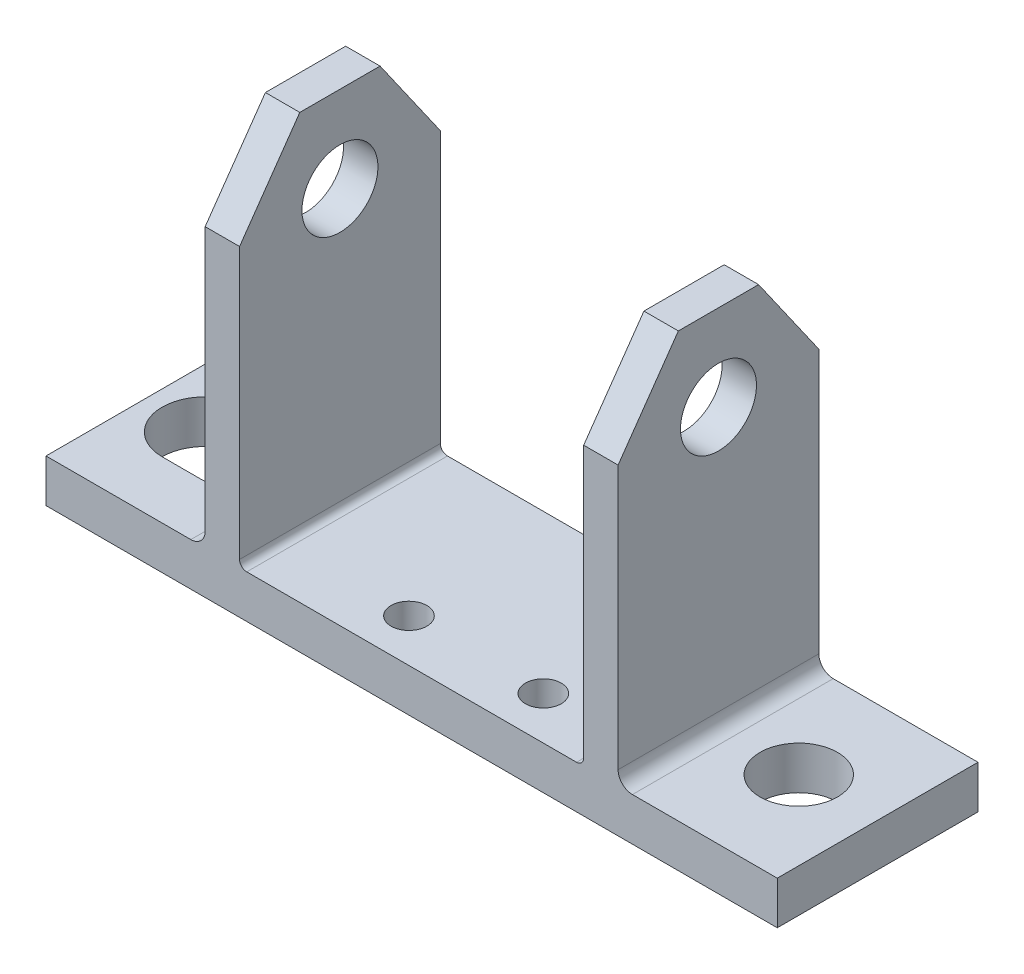
ISO-10303-21;
HEADER;
FILE_DESCRIPTION(('STEP AP214'),'2;1');
FILE_NAME('part.step','',(''),(''),'','','');
FILE_SCHEMA(('AUTOMOTIVE_DESIGN { 1 0 10303 214 1 1 1 1 }'));
ENDSEC;
DATA;
#1=APPLICATION_CONTEXT('core data for automotive mechanical design processes');
#2=APPLICATION_PROTOCOL_DEFINITION('international standard','automotive_design',2000,#1);
#3=PRODUCT_CONTEXT('',#1,'mechanical');
#4=PRODUCT('Part','Part','',(#3));
#5=PRODUCT_RELATED_PRODUCT_CATEGORY('part','',(#4));
#6=PRODUCT_DEFINITION_FORMATION('','',#4);
#7=PRODUCT_DEFINITION_CONTEXT('part definition',#1,'design');
#8=PRODUCT_DEFINITION('design','',#6,#7);
#9=PRODUCT_DEFINITION_SHAPE('','',#8);
#10=(LENGTH_UNIT() NAMED_UNIT(*) SI_UNIT(.MILLI.,.METRE.));
#11=(NAMED_UNIT(*) PLANE_ANGLE_UNIT() SI_UNIT($,.RADIAN.));
#12=(NAMED_UNIT(*) SI_UNIT($,.STERADIAN.) SOLID_ANGLE_UNIT());
#13=UNCERTAINTY_MEASURE_WITH_UNIT(LENGTH_MEASURE(1.E-05),#10,'distance_accuracy_value','');
#14=(GEOMETRIC_REPRESENTATION_CONTEXT(3) GLOBAL_UNCERTAINTY_ASSIGNED_CONTEXT((#13)) GLOBAL_UNIT_ASSIGNED_CONTEXT((#10,
#11,#12)) REPRESENTATION_CONTEXT('',''));
#15=CARTESIAN_POINT('',(0.,0.,0.));
#16=DIRECTION('',(0.,0.,1.));
#17=DIRECTION('',(1.,0.,0.));
#18=AXIS2_PLACEMENT_3D('',#15,#16,#17);
#19=CARTESIAN_POINT('',(0.,3.,0.));
#20=DIRECTION('',(0.,-1.,0.));
#21=DIRECTION('',(0.,0.,-1.));
#22=AXIS2_PLACEMENT_3D('',#19,#20,#21);
#23=PLANE('',#22);
#24=CARTESIAN_POINT('',(31.686,3.,-3.));
#25=DIRECTION('',(0.,1.,0.));
#26=DIRECTION('',(0.,0.,1.));
#27=AXIS2_PLACEMENT_3D('',#24,#25,#26);
#28=CIRCLE('',#27,1.25);
#29=CARTESIAN_POINT('',(31.686,3.,-1.75000000000001));
#30=VERTEX_POINT('',#29);
#31=EDGE_CURVE('E420',#30,#30,#28,.T.);
#32=ORIENTED_EDGE('',*,*,#31,.F.);
#33=EDGE_LOOP('',(#32));
#34=FACE_BOUND('',#33,.T.);
#35=CARTESIAN_POINT('',(22.314,3.,-3.));
#36=DIRECTION('',(0.,1.,0.));
#37=DIRECTION('',(0.,0.,1.));
#38=AXIS2_PLACEMENT_3D('',#35,#36,#37);
#39=CIRCLE('',#38,1.25);
#40=CARTESIAN_POINT('',(22.314,3.,-1.75));
#41=VERTEX_POINT('',#40);
#42=EDGE_CURVE('E374',#41,#41,#39,.T.);
#43=ORIENTED_EDGE('',*,*,#42,.F.);
#44=EDGE_LOOP('',(#43));
#45=FACE_BOUND('',#44,.T.);
#46=DIRECTION('',(1.,0.,0.));
#47=VECTOR('',#46,1.);
#48=CARTESIAN_POINT('',(0.,3.,0.));
#49=LINE('',#48,#47);
#50=CARTESIAN_POINT('',(14.,3.,0.));
#51=VERTEX_POINT('',#50);
#52=CARTESIAN_POINT('',(37.,3.,0.));
#53=VERTEX_POINT('',#52);
#54=EDGE_CURVE('E280',#51,#53,#49,.T.);
#55=ORIENTED_EDGE('',*,*,#54,.T.);
#56=DIRECTION('',(0.,0.,1.));
#57=VECTOR('',#56,1.);
#58=CARTESIAN_POINT('',(37.,3.,-14.));
#59=LINE('',#58,#57);
#60=CARTESIAN_POINT('',(37.,3.,-14.));
#61=VERTEX_POINT('',#60);
#62=EDGE_CURVE('E445',#53,#61,#59,.F.);
#63=ORIENTED_EDGE('',*,*,#62,.T.);
#64=DIRECTION('',(-1.,0.,0.));
#65=VECTOR('',#64,1.);
#66=CARTESIAN_POINT('',(0.,3.,-14.));
#67=LINE('',#66,#65);
#68=CARTESIAN_POINT('',(14.,3.,-14.));
#69=VERTEX_POINT('',#68);
#70=EDGE_CURVE('E295',#61,#69,#67,.T.);
#71=ORIENTED_EDGE('',*,*,#70,.T.);
#72=DIRECTION('',(0.,0.,-1.));
#73=VECTOR('',#72,1.);
#74=CARTESIAN_POINT('',(14.,3.,0.));
#75=LINE('',#74,#73);
#76=EDGE_CURVE('E312',#69,#51,#75,.F.);
#77=ORIENTED_EDGE('',*,*,#76,.T.);
#78=EDGE_LOOP('',(#55,#63,#71,#77));
#79=FACE_BOUND('',#78,.T.);
#80=ADVANCED_FACE('F34',(#34,#45,#79),#23,.F.);
#81=CARTESIAN_POINT('',(45.5,3.,-7.00000000000001));
#82=DIRECTION('',(0.,1.,0.));
#83=DIRECTION('',(0.,0.,1.));
#84=AXIS2_PLACEMENT_3D('',#81,#82,#83);
#85=CIRCLE('',#84,2.7);
#86=CARTESIAN_POINT('',(45.5,3.,-4.30000000000001));
#87=VERTEX_POINT('',#86);
#88=EDGE_CURVE('E229',#87,#87,#85,.T.);
#89=ORIENTED_EDGE('',*,*,#88,.F.);
#90=EDGE_LOOP('',(#89));
#91=FACE_BOUND('',#90,.T.);
#92=CARTESIAN_POINT('',(51.,3.,-14.));
#93=VERTEX_POINT('',#92);
#94=CARTESIAN_POINT('',(40.9,3.,-14.));
#95=VERTEX_POINT('',#94);
#96=EDGE_CURVE('E291',#93,#95,#67,.T.);
#97=ORIENTED_EDGE('',*,*,#96,.T.);
#98=DIRECTION('',(0.,0.,-1.));
#99=VECTOR('',#98,1.);
#100=CARTESIAN_POINT('',(40.9,3.,0.));
#101=LINE('',#100,#99);
#102=CARTESIAN_POINT('',(40.9,3.,0.));
#103=VERTEX_POINT('',#102);
#104=EDGE_CURVE('E325',#95,#103,#101,.F.);
#105=ORIENTED_EDGE('',*,*,#104,.T.);
#106=CARTESIAN_POINT('',(51.,3.,0.));
#107=VERTEX_POINT('',#106);
#108=EDGE_CURVE('E271',#103,#107,#49,.T.);
#109=ORIENTED_EDGE('',*,*,#108,.T.);
#110=DIRECTION('',(0.,0.,-1.));
#111=VECTOR('',#110,1.);
#112=CARTESIAN_POINT('',(51.,3.,0.));
#113=LINE('',#112,#111);
#114=EDGE_CURVE('E275',#107,#93,#113,.T.);
#115=ORIENTED_EDGE('',*,*,#114,.T.);
#116=EDGE_LOOP('',(#97,#105,#109,#115));
#117=FACE_BOUND('',#116,.T.);
#118=ADVANCED_FACE('F439',(#91,#117),#23,.F.);
#119=CARTESIAN_POINT('',(4.09999999999999,3.,-7.00000000000001));
#120=DIRECTION('',(0.,1.,0.));
#121=DIRECTION('',(0.,0.,1.));
#122=AXIS2_PLACEMENT_3D('',#119,#120,#121);
#123=CIRCLE('',#122,3.);
#124=CARTESIAN_POINT('',(4.09999999999999,3.,-10.));
#125=VERTEX_POINT('',#124);
#126=CARTESIAN_POINT('',(4.09999999999999,3.,-4.));
#127=VERTEX_POINT('',#126);
#128=EDGE_CURVE('E237',#125,#127,#123,.T.);
#129=ORIENTED_EDGE('',*,*,#128,.F.);
#130=DIRECTION('',(-1.,0.,0.));
#131=VECTOR('',#130,1.);
#132=CARTESIAN_POINT('',(4.09999999999999,3.,-10.));
#133=LINE('',#132,#131);
#134=CARTESIAN_POINT('',(6.9,3.,-10.));
#135=VERTEX_POINT('',#134);
#136=EDGE_CURVE('E245',#135,#125,#133,.T.);
#137=ORIENTED_EDGE('',*,*,#136,.F.);
#138=CARTESIAN_POINT('',(6.9,3.,-7.00000000000001));
#139=DIRECTION('',(0.,1.,0.));
#140=DIRECTION('',(0.,0.,1.));
#141=AXIS2_PLACEMENT_3D('',#138,#139,#140);
#142=CIRCLE('',#141,3.);
#143=CARTESIAN_POINT('',(6.9,3.,-4.));
#144=VERTEX_POINT('',#143);
#145=EDGE_CURVE('E242',#144,#135,#142,.T.);
#146=ORIENTED_EDGE('',*,*,#145,.F.);
#147=DIRECTION('',(1.,0.,0.));
#148=VECTOR('',#147,1.);
#149=CARTESIAN_POINT('',(4.09999999999999,3.,-4.));
#150=LINE('',#149,#148);
#151=EDGE_CURVE('E239',#127,#144,#150,.T.);
#152=ORIENTED_EDGE('',*,*,#151,.F.);
#153=EDGE_LOOP('',(#129,#137,#146,#152));
#154=FACE_BOUND('',#153,.T.);
#155=CARTESIAN_POINT('',(0.,3.,0.));
#156=VERTEX_POINT('',#155);
#157=CARTESIAN_POINT('',(10.1,3.,0.));
#158=VERTEX_POINT('',#157);
#159=EDGE_CURVE('E285',#156,#158,#49,.T.);
#160=ORIENTED_EDGE('',*,*,#159,.T.);
#161=DIRECTION('',(0.,0.,1.));
#162=VECTOR('',#161,1.);
#163=CARTESIAN_POINT('',(10.1,3.,-14.));
#164=LINE('',#163,#162);
#165=CARTESIAN_POINT('',(10.1,3.,-14.));
#166=VERTEX_POINT('',#165);
#167=EDGE_CURVE('E320',#158,#166,#164,.F.);
#168=ORIENTED_EDGE('',*,*,#167,.T.);
#169=CARTESIAN_POINT('',(0.,3.,-14.));
#170=VERTEX_POINT('',#169);
#171=EDGE_CURVE('E304',#166,#170,#67,.T.);
#172=ORIENTED_EDGE('',*,*,#171,.T.);
#173=DIRECTION('',(0.,0.,1.));
#174=VECTOR('',#173,1.);
#175=CARTESIAN_POINT('',(0.,3.,0.));
#176=LINE('',#175,#174);
#177=EDGE_CURVE('E268',#170,#156,#176,.T.);
#178=ORIENTED_EDGE('',*,*,#177,.T.);
#179=EDGE_LOOP('',(#160,#168,#172,#178));
#180=FACE_BOUND('',#179,.T.);
#181=ADVANCED_FACE('F441',(#154,#180),#23,.F.);
#182=CARTESIAN_POINT('',(0.,0.,0.));
#183=DIRECTION('',(0.,-1.,0.));
#184=DIRECTION('',(0.,0.,-1.));
#185=AXIS2_PLACEMENT_3D('',#182,#183,#184);
#186=PLANE('',#185);
#187=CARTESIAN_POINT('',(31.686,0.,-3.));
#188=DIRECTION('',(0.,-1.,0.));
#189=DIRECTION('',(0.,0.,-1.));
#190=AXIS2_PLACEMENT_3D('',#187,#188,#189);
#191=CIRCLE('',#190,1.25);
#192=CARTESIAN_POINT('',(31.686,0.,-4.25));
#193=VERTEX_POINT('',#192);
#194=EDGE_CURVE('E419',#193,#193,#191,.F.);
#195=ORIENTED_EDGE('',*,*,#194,.T.);
#196=EDGE_LOOP('',(#195));
#197=FACE_BOUND('',#196,.T.);
#198=CARTESIAN_POINT('',(22.314,0.,-3.));
#199=DIRECTION('',(0.,-1.,0.));
#200=DIRECTION('',(0.,0.,-1.));
#201=AXIS2_PLACEMENT_3D('',#198,#199,#200);
#202=CIRCLE('',#201,1.25);
#203=CARTESIAN_POINT('',(22.314,0.,-4.25));
#204=VERTEX_POINT('',#203);
#205=EDGE_CURVE('E379',#204,#204,#202,.F.);
#206=ORIENTED_EDGE('',*,*,#205,.T.);
#207=EDGE_LOOP('',(#206));
#208=FACE_BOUND('',#207,.T.);
#209=DIRECTION('',(-1.,0.,0.));
#210=VECTOR('',#209,1.);
#211=CARTESIAN_POINT('',(4.09999999999999,0.,-10.));
#212=LINE('',#211,#210);
#213=CARTESIAN_POINT('',(6.9,0.,-10.));
#214=VERTEX_POINT('',#213);
#215=CARTESIAN_POINT('',(4.09999999999999,0.,-10.));
#216=VERTEX_POINT('',#215);
#217=EDGE_CURVE('E240',#214,#216,#212,.T.);
#218=ORIENTED_EDGE('',*,*,#217,.T.);
#219=CARTESIAN_POINT('',(4.09999999999999,0.,-7.00000000000001));
#220=DIRECTION('',(0.,1.,0.));
#221=DIRECTION('',(0.,0.,1.));
#222=AXIS2_PLACEMENT_3D('',#219,#220,#221);
#223=CIRCLE('',#222,3.);
#224=CARTESIAN_POINT('',(4.09999999999999,0.,-4.));
#225=VERTEX_POINT('',#224);
#226=EDGE_CURVE('E232',#216,#225,#223,.T.);
#227=ORIENTED_EDGE('',*,*,#226,.T.);
#228=DIRECTION('',(1.,0.,0.));
#229=VECTOR('',#228,1.);
#230=CARTESIAN_POINT('',(4.09999999999999,0.,-4.));
#231=LINE('',#230,#229);
#232=CARTESIAN_POINT('',(6.9,0.,-4.));
#233=VERTEX_POINT('',#232);
#234=EDGE_CURVE('E250',#225,#233,#231,.T.);
#235=ORIENTED_EDGE('',*,*,#234,.T.);
#236=CARTESIAN_POINT('',(6.9,0.,-7.00000000000001));
#237=DIRECTION('',(0.,1.,0.));
#238=DIRECTION('',(0.,0.,1.));
#239=AXIS2_PLACEMENT_3D('',#236,#237,#238);
#240=CIRCLE('',#239,3.);
#241=EDGE_CURVE('E253',#233,#214,#240,.T.);
#242=ORIENTED_EDGE('',*,*,#241,.T.);
#243=EDGE_LOOP('',(#218,#227,#235,#242));
#244=FACE_BOUND('',#243,.T.);
#245=DIRECTION('',(0.,0.,1.));
#246=VECTOR('',#245,1.);
#247=CARTESIAN_POINT('',(0.,0.,0.));
#248=LINE('',#247,#246);
#249=CARTESIAN_POINT('',(0.,0.,-14.));
#250=VERTEX_POINT('',#249);
#251=CARTESIAN_POINT('',(0.,0.,0.));
#252=VERTEX_POINT('',#251);
#253=EDGE_CURVE('E267',#250,#252,#248,.T.);
#254=ORIENTED_EDGE('',*,*,#253,.F.);
#255=DIRECTION('',(-1.,0.,0.));
#256=VECTOR('',#255,1.);
#257=CARTESIAN_POINT('',(0.,0.,-14.));
#258=LINE('',#257,#256);
#259=CARTESIAN_POINT('',(51.,0.,-14.));
#260=VERTEX_POINT('',#259);
#261=EDGE_CURVE('E272',#260,#250,#258,.T.);
#262=ORIENTED_EDGE('',*,*,#261,.F.);
#263=DIRECTION('',(0.,0.,-1.));
#264=VECTOR('',#263,1.);
#265=CARTESIAN_POINT('',(51.,0.,0.));
#266=LINE('',#265,#264);
#267=CARTESIAN_POINT('',(51.,0.,0.));
#268=VERTEX_POINT('',#267);
#269=EDGE_CURVE('E773',#268,#260,#266,.T.);
#270=ORIENTED_EDGE('',*,*,#269,.F.);
#271=DIRECTION('',(1.,0.,0.));
#272=VECTOR('',#271,1.);
#273=CARTESIAN_POINT('',(0.,0.,0.));
#274=LINE('',#273,#272);
#275=EDGE_CURVE('E764',#252,#268,#274,.T.);
#276=ORIENTED_EDGE('',*,*,#275,.F.);
#277=EDGE_LOOP('',(#254,#262,#270,#276));
#278=FACE_BOUND('',#277,.T.);
#279=CARTESIAN_POINT('',(45.5,0.,-7.00000000000001));
#280=DIRECTION('',(0.,1.,0.));
#281=DIRECTION('',(0.,0.,1.));
#282=AXIS2_PLACEMENT_3D('',#279,#280,#281);
#283=CIRCLE('',#282,2.7);
#284=CARTESIAN_POINT('',(45.5,0.,-4.30000000000001));
#285=VERTEX_POINT('',#284);
#286=EDGE_CURVE('E233',#285,#285,#283,.T.);
#287=ORIENTED_EDGE('',*,*,#286,.T.);
#288=EDGE_LOOP('',(#287));
#289=FACE_BOUND('',#288,.T.);
#290=ADVANCED_FACE('F426',(#197,#208,#244,#278,#289),#186,.T.);
#291=CARTESIAN_POINT('',(0.,3.,0.));
#292=DIRECTION('',(1.,0.,0.));
#293=DIRECTION('',(0.,0.,-1.));
#294=AXIS2_PLACEMENT_3D('',#291,#292,#293);
#295=PLANE('',#294);
#296=ORIENTED_EDGE('',*,*,#253,.T.);
#297=DIRECTION('',(0.,-1.,0.));
#298=VECTOR('',#297,1.);
#299=CARTESIAN_POINT('',(0.,3.,0.));
#300=LINE('',#299,#298);
#301=EDGE_CURVE('E289',#156,#252,#300,.T.);
#302=ORIENTED_EDGE('',*,*,#301,.F.);
#303=ORIENTED_EDGE('',*,*,#177,.F.);
#304=DIRECTION('',(0.,-1.,0.));
#305=VECTOR('',#304,1.);
#306=CARTESIAN_POINT('',(0.,3.,-14.));
#307=LINE('',#306,#305);
#308=EDGE_CURVE('E294',#170,#250,#307,.T.);
#309=ORIENTED_EDGE('',*,*,#308,.T.);
#310=EDGE_LOOP('',(#296,#302,#303,#309));
#311=FACE_BOUND('',#310,.T.);
#312=ADVANCED_FACE('F529',(#311),#295,.F.);
#313=CARTESIAN_POINT('',(0.,3.,0.));
#314=DIRECTION('',(0.,0.,-1.));
#315=DIRECTION('',(-1.,0.,0.));
#316=AXIS2_PLACEMENT_3D('',#313,#314,#315);
#317=PLANE('',#316);
#318=DIRECTION('',(0.,-1.,0.));
#319=VECTOR('',#318,1.);
#320=CARTESIAN_POINT('',(39.9,28.4,0.));
#321=LINE('',#320,#319);
#322=CARTESIAN_POINT('',(39.9,22.4,0.));
#323=VERTEX_POINT('',#322);
#324=CARTESIAN_POINT('',(39.9,4.,0.));
#325=VERTEX_POINT('',#324);
#326=EDGE_CURVE('E387',#323,#325,#321,.T.);
#327=ORIENTED_EDGE('',*,*,#326,.F.);
#328=DIRECTION('',(-1.,0.,0.));
#329=VECTOR('',#328,1.);
#330=CARTESIAN_POINT('',(51.,22.4,0.));
#331=LINE('',#330,#329);
#332=CARTESIAN_POINT('',(37.5,22.4,0.));
#333=VERTEX_POINT('',#332);
#334=EDGE_CURVE('E393',#323,#333,#331,.T.);
#335=ORIENTED_EDGE('',*,*,#334,.T.);
#336=DIRECTION('',(0.,-1.,0.));
#337=VECTOR('',#336,1.);
#338=CARTESIAN_POINT('',(37.5,28.4,0.));
#339=LINE('',#338,#337);
#340=CARTESIAN_POINT('',(37.5,3.5,0.));
#341=VERTEX_POINT('',#340);
#342=EDGE_CURVE('E225',#333,#341,#339,.T.);
#343=ORIENTED_EDGE('',*,*,#342,.T.);
#344=CARTESIAN_POINT('',(37.,3.5,0.));
#345=DIRECTION('',(0.,0.,-1.));
#346=DIRECTION('',(-1.,0.,0.));
#347=AXIS2_PLACEMENT_3D('',#344,#345,#346);
#348=CIRCLE('',#347,0.5);
#349=EDGE_CURVE('E391',#341,#53,#348,.T.);
#350=ORIENTED_EDGE('',*,*,#349,.T.);
#351=ORIENTED_EDGE('',*,*,#54,.F.);
#352=CARTESIAN_POINT('',(14.,3.5,0.));
#353=DIRECTION('',(0.,0.,-1.));
#354=DIRECTION('',(-1.,0.,0.));
#355=AXIS2_PLACEMENT_3D('',#352,#353,#354);
#356=CIRCLE('',#355,0.5);
#357=CARTESIAN_POINT('',(13.5,3.5,0.));
#358=VERTEX_POINT('',#357);
#359=EDGE_CURVE('E11',#51,#358,#356,.T.);
#360=ORIENTED_EDGE('',*,*,#359,.T.);
#361=DIRECTION('',(0.,-1.,0.));
#362=VECTOR('',#361,1.);
#363=CARTESIAN_POINT('',(13.5,28.4,0.));
#364=LINE('',#363,#362);
#365=CARTESIAN_POINT('',(13.5,22.4,0.));
#366=VERTEX_POINT('',#365);
#367=EDGE_CURVE('E221',#366,#358,#364,.T.);
#368=ORIENTED_EDGE('',*,*,#367,.F.);
#369=CARTESIAN_POINT('',(11.1,22.4,0.));
#370=VERTEX_POINT('',#369);
#371=EDGE_CURVE('E204',#366,#370,#331,.T.);
#372=ORIENTED_EDGE('',*,*,#371,.T.);
#373=DIRECTION('',(0.,-1.,0.));
#374=VECTOR('',#373,1.);
#375=CARTESIAN_POINT('',(11.1,28.4,0.));
#376=LINE('',#375,#374);
#377=CARTESIAN_POINT('',(11.1,4.,0.));
#378=VERTEX_POINT('',#377);
#379=EDGE_CURVE('E215',#370,#378,#376,.T.);
#380=ORIENTED_EDGE('',*,*,#379,.T.);
#381=CARTESIAN_POINT('',(10.1,4.,0.));
#382=DIRECTION('',(0.,0.,-1.));
#383=DIRECTION('',(-1.,0.,0.));
#384=AXIS2_PLACEMENT_3D('',#381,#382,#383);
#385=CIRCLE('',#384,1.);
#386=EDGE_CURVE('E315',#378,#158,#385,.T.);
#387=ORIENTED_EDGE('',*,*,#386,.T.);
#388=ORIENTED_EDGE('',*,*,#159,.F.);
#389=ORIENTED_EDGE('',*,*,#301,.T.);
#390=ORIENTED_EDGE('',*,*,#275,.T.);
#391=DIRECTION('',(0.,-1.,0.));
#392=VECTOR('',#391,1.);
#393=CARTESIAN_POINT('',(51.,3.,0.));
#394=LINE('',#393,#392);
#395=EDGE_CURVE('E763',#107,#268,#394,.T.);
#396=ORIENTED_EDGE('',*,*,#395,.F.);
#397=ORIENTED_EDGE('',*,*,#108,.F.);
#398=CARTESIAN_POINT('',(40.9,4.,0.));
#399=DIRECTION('',(0.,0.,-1.));
#400=DIRECTION('',(-1.,0.,0.));
#401=AXIS2_PLACEMENT_3D('',#398,#399,#400);
#402=CIRCLE('',#401,1.);
#403=EDGE_CURVE('E317',#103,#325,#402,.T.);
#404=ORIENTED_EDGE('',*,*,#403,.T.);
#405=EDGE_LOOP('',(#327,#335,#343,#350,#351,#360,#368,#372,#380,#387,#388,#389,#390,#396,#397,#404));
#406=FACE_BOUND('',#405,.T.);
#407=ADVANCED_FACE('F390',(#406),#317,.F.);
#408=CARTESIAN_POINT('',(51.,3.,0.));
#409=DIRECTION('',(-1.,0.,0.));
#410=DIRECTION('',(0.,0.,1.));
#411=AXIS2_PLACEMENT_3D('',#408,#409,#410);
#412=PLANE('',#411);
#413=ORIENTED_EDGE('',*,*,#269,.T.);
#414=DIRECTION('',(0.,-1.,0.));
#415=VECTOR('',#414,1.);
#416=CARTESIAN_POINT('',(51.,3.,-14.));
#417=LINE('',#416,#415);
#418=EDGE_CURVE('E766',#93,#260,#417,.T.);
#419=ORIENTED_EDGE('',*,*,#418,.F.);
#420=ORIENTED_EDGE('',*,*,#114,.F.);
#421=ORIENTED_EDGE('',*,*,#395,.T.);
#422=EDGE_LOOP('',(#413,#419,#420,#421));
#423=FACE_BOUND('',#422,.T.);
#424=ADVANCED_FACE('F532',(#423),#412,.F.);
#425=CARTESIAN_POINT('',(0.,3.,-14.));
#426=DIRECTION('',(0.,0.,1.));
#427=DIRECTION('',(1.,0.,0.));
#428=AXIS2_PLACEMENT_3D('',#425,#426,#427);
#429=PLANE('',#428);
#430=DIRECTION('',(0.,-1.,0.));
#431=VECTOR('',#430,1.);
#432=CARTESIAN_POINT('',(11.1,28.4,-14.));
#433=LINE('',#432,#431);
#434=CARTESIAN_POINT('',(11.1,22.4,-14.));
#435=VERTEX_POINT('',#434);
#436=CARTESIAN_POINT('',(11.1,4.,-14.));
#437=VERTEX_POINT('',#436);
#438=EDGE_CURVE('E347',#435,#437,#433,.T.);
#439=ORIENTED_EDGE('',*,*,#438,.F.);
#440=DIRECTION('',(-1.,0.,0.));
#441=VECTOR('',#440,1.);
#442=CARTESIAN_POINT('',(51.,22.4,-14.));
#443=LINE('',#442,#441);
#444=CARTESIAN_POINT('',(13.5,22.4,-14.));
#445=VERTEX_POINT('',#444);
#446=EDGE_CURVE('E400',#445,#435,#443,.T.);
#447=ORIENTED_EDGE('',*,*,#446,.F.);
#448=DIRECTION('',(0.,-1.,0.));
#449=VECTOR('',#448,1.);
#450=CARTESIAN_POINT('',(13.5,28.4,-14.));
#451=LINE('',#450,#449);
#452=CARTESIAN_POINT('',(13.5,3.5,-14.));
#453=VERTEX_POINT('',#452);
#454=EDGE_CURVE('E236',#445,#453,#451,.T.);
#455=ORIENTED_EDGE('',*,*,#454,.T.);
#456=CARTESIAN_POINT('',(14.,3.5,-14.));
#457=DIRECTION('',(0.,0.,1.));
#458=DIRECTION('',(1.,0.,0.));
#459=AXIS2_PLACEMENT_3D('',#456,#457,#458);
#460=CIRCLE('',#459,0.5);
#461=EDGE_CURVE('E42',#453,#69,#460,.T.);
#462=ORIENTED_EDGE('',*,*,#461,.T.);
#463=ORIENTED_EDGE('',*,*,#70,.F.);
#464=CARTESIAN_POINT('',(37.,3.5,-14.));
#465=DIRECTION('',(0.,0.,1.));
#466=DIRECTION('',(1.,0.,0.));
#467=AXIS2_PLACEMENT_3D('',#464,#465,#466);
#468=CIRCLE('',#467,0.5);
#469=CARTESIAN_POINT('',(37.5,3.5,-14.));
#470=VERTEX_POINT('',#469);
#471=EDGE_CURVE('E451',#61,#470,#468,.T.);
#472=ORIENTED_EDGE('',*,*,#471,.T.);
#473=DIRECTION('',(0.,-1.,0.));
#474=VECTOR('',#473,1.);
#475=CARTESIAN_POINT('',(37.5,28.4,-14.));
#476=LINE('',#475,#474);
#477=CARTESIAN_POINT('',(37.5,22.4,-14.));
#478=VERTEX_POINT('',#477);
#479=EDGE_CURVE('E376',#478,#470,#476,.T.);
#480=ORIENTED_EDGE('',*,*,#479,.F.);
#481=CARTESIAN_POINT('',(39.9,22.4,-14.));
#482=VERTEX_POINT('',#481);
#483=EDGE_CURVE('E403',#482,#478,#443,.T.);
#484=ORIENTED_EDGE('',*,*,#483,.F.);
#485=DIRECTION('',(0.,-1.,0.));
#486=VECTOR('',#485,1.);
#487=CARTESIAN_POINT('',(39.9,28.4,-14.));
#488=LINE('',#487,#486);
#489=CARTESIAN_POINT('',(39.9,4.,-14.));
#490=VERTEX_POINT('',#489);
#491=EDGE_CURVE('E384',#482,#490,#488,.T.);
#492=ORIENTED_EDGE('',*,*,#491,.T.);
#493=CARTESIAN_POINT('',(40.9,4.,-14.));
#494=DIRECTION('',(0.,0.,1.));
#495=DIRECTION('',(1.,0.,0.));
#496=AXIS2_PLACEMENT_3D('',#493,#494,#495);
#497=CIRCLE('',#496,1.);
#498=EDGE_CURVE('E319',#490,#95,#497,.T.);
#499=ORIENTED_EDGE('',*,*,#498,.T.);
#500=ORIENTED_EDGE('',*,*,#96,.F.);
#501=ORIENTED_EDGE('',*,*,#418,.T.);
#502=ORIENTED_EDGE('',*,*,#261,.T.);
#503=ORIENTED_EDGE('',*,*,#308,.F.);
#504=ORIENTED_EDGE('',*,*,#171,.F.);
#505=CARTESIAN_POINT('',(10.1,4.,-14.));
#506=DIRECTION('',(0.,0.,1.));
#507=DIRECTION('',(1.,0.,0.));
#508=AXIS2_PLACEMENT_3D('',#505,#506,#507);
#509=CIRCLE('',#508,1.);
#510=EDGE_CURVE('E313',#166,#437,#509,.T.);
#511=ORIENTED_EDGE('',*,*,#510,.T.);
#512=EDGE_LOOP('',(#439,#447,#455,#462,#463,#472,#480,#484,#492,#499,#500,#501,#502,#503,#504,#511));
#513=FACE_BOUND('',#512,.T.);
#514=ADVANCED_FACE('F459',(#513),#429,.F.);
#515=CARTESIAN_POINT('',(4.09999999999999,3.,-7.00000000000001));
#516=DIRECTION('',(0.,-1.,0.));
#517=DIRECTION('',(0.,0.,-1.));
#518=AXIS2_PLACEMENT_3D('',#515,#516,#517);
#519=CYLINDRICAL_SURFACE('',#518,3.);
#520=ORIENTED_EDGE('',*,*,#226,.F.);
#521=DIRECTION('',(0.,-1.,0.));
#522=VECTOR('',#521,1.);
#523=CARTESIAN_POINT('',(4.09999999999999,3.,-10.));
#524=LINE('',#523,#522);
#525=EDGE_CURVE('E247',#125,#216,#524,.T.);
#526=ORIENTED_EDGE('',*,*,#525,.F.);
#527=ORIENTED_EDGE('',*,*,#128,.T.);
#528=DIRECTION('',(0.,-1.,0.));
#529=VECTOR('',#528,1.);
#530=CARTESIAN_POINT('',(4.09999999999999,3.,-4.));
#531=LINE('',#530,#529);
#532=EDGE_CURVE('E264',#127,#225,#531,.T.);
#533=ORIENTED_EDGE('',*,*,#532,.T.);
#534=EDGE_LOOP('',(#520,#526,#527,#533));
#535=FACE_BOUND('',#534,.T.);
#536=ADVANCED_FACE('F522',(#535),#519,.F.);
#537=CARTESIAN_POINT('',(4.09999999999999,3.,-4.));
#538=DIRECTION('',(0.,0.,-1.));
#539=DIRECTION('',(-1.,0.,0.));
#540=AXIS2_PLACEMENT_3D('',#537,#538,#539);
#541=PLANE('',#540);
#542=ORIENTED_EDGE('',*,*,#234,.F.);
#543=ORIENTED_EDGE('',*,*,#532,.F.);
#544=ORIENTED_EDGE('',*,*,#151,.T.);
#545=DIRECTION('',(0.,-1.,0.));
#546=VECTOR('',#545,1.);
#547=CARTESIAN_POINT('',(6.9,3.,-4.));
#548=LINE('',#547,#546);
#549=EDGE_CURVE('E262',#144,#233,#548,.T.);
#550=ORIENTED_EDGE('',*,*,#549,.T.);
#551=EDGE_LOOP('',(#542,#543,#544,#550));
#552=FACE_BOUND('',#551,.T.);
#553=ADVANCED_FACE('F518',(#552),#541,.T.);
#554=CARTESIAN_POINT('',(6.9,3.,-7.00000000000001));
#555=DIRECTION('',(0.,-1.,0.));
#556=DIRECTION('',(0.,0.,-1.));
#557=AXIS2_PLACEMENT_3D('',#554,#555,#556);
#558=CYLINDRICAL_SURFACE('',#557,3.);
#559=ORIENTED_EDGE('',*,*,#241,.F.);
#560=ORIENTED_EDGE('',*,*,#549,.F.);
#561=ORIENTED_EDGE('',*,*,#145,.T.);
#562=DIRECTION('',(0.,-1.,0.));
#563=VECTOR('',#562,1.);
#564=CARTESIAN_POINT('',(6.9,3.,-10.));
#565=LINE('',#564,#563);
#566=EDGE_CURVE('E260',#135,#214,#565,.T.);
#567=ORIENTED_EDGE('',*,*,#566,.T.);
#568=EDGE_LOOP('',(#559,#560,#561,#567));
#569=FACE_BOUND('',#568,.T.);
#570=ADVANCED_FACE('F514',(#569),#558,.F.);
#571=CARTESIAN_POINT('',(4.09999999999999,3.,-10.));
#572=DIRECTION('',(0.,0.,1.));
#573=DIRECTION('',(1.,0.,0.));
#574=AXIS2_PLACEMENT_3D('',#571,#572,#573);
#575=PLANE('',#574);
#576=ORIENTED_EDGE('',*,*,#217,.F.);
#577=ORIENTED_EDGE('',*,*,#566,.F.);
#578=ORIENTED_EDGE('',*,*,#136,.T.);
#579=ORIENTED_EDGE('',*,*,#525,.T.);
#580=EDGE_LOOP('',(#576,#577,#578,#579));
#581=FACE_BOUND('',#580,.T.);
#582=ADVANCED_FACE('F510',(#581),#575,.T.);
#583=CARTESIAN_POINT('',(45.5,3.,-7.00000000000001));
#584=DIRECTION('',(0.,-1.,0.));
#585=DIRECTION('',(0.,0.,-1.));
#586=AXIS2_PLACEMENT_3D('',#583,#584,#585);
#587=CYLINDRICAL_SURFACE('',#586,2.7);
#588=ORIENTED_EDGE('',*,*,#88,.T.);
#589=EDGE_LOOP('',(#588));
#590=FACE_BOUND('',#589,.T.);
#591=ORIENTED_EDGE('',*,*,#286,.F.);
#592=EDGE_LOOP('',(#591));
#593=FACE_BOUND('',#592,.T.);
#594=ADVANCED_FACE('F506',(#590,#593),#587,.F.);
#595=CARTESIAN_POINT('',(13.5,28.4,-14.));
#596=DIRECTION('',(-1.,0.,0.));
#597=DIRECTION('',(0.,0.,1.));
#598=AXIS2_PLACEMENT_3D('',#595,#596,#597);
#599=PLANE('',#598);
#600=CARTESIAN_POINT('',(13.5,22.4,-7.00000000000001));
#601=DIRECTION('',(-1.,0.,0.));
#602=DIRECTION('',(0.,0.,1.));
#603=AXIS2_PLACEMENT_3D('',#600,#601,#602);
#604=CIRCLE('',#603,2.65);
#605=CARTESIAN_POINT('',(13.5,22.4,-4.35000000000001));
#606=VERTEX_POINT('',#605);
#607=EDGE_CURVE('E416',#606,#606,#604,.T.);
#608=ORIENTED_EDGE('',*,*,#607,.T.);
#609=EDGE_LOOP('',(#608));
#610=FACE_BOUND('',#609,.T.);
#611=ORIENTED_EDGE('',*,*,#367,.T.);
#612=DIRECTION('',(0.,0.,-1.));
#613=VECTOR('',#612,1.);
#614=CARTESIAN_POINT('',(13.5,3.5,-14.));
#615=LINE('',#614,#613);
#616=EDGE_CURVE('E452',#358,#453,#615,.T.);
#617=ORIENTED_EDGE('',*,*,#616,.T.);
#618=ORIENTED_EDGE('',*,*,#454,.F.);
#619=DIRECTION('',(0.,0.819152044288995,0.573576436351042));
#620=VECTOR('',#619,1.);
#621=CARTESIAN_POINT('',(13.5,26.426060429977,-11.1809221376423));
#622=LINE('',#621,#620);
#623=CARTESIAN_POINT('',(13.5,28.4,-9.7987547707418));
#624=VERTEX_POINT('',#623);
#625=EDGE_CURVE('E409',#445,#624,#622,.T.);
#626=ORIENTED_EDGE('',*,*,#625,.T.);
#627=DIRECTION('',(0.,0.,-1.));
#628=VECTOR('',#627,1.);
#629=CARTESIAN_POINT('',(13.5,28.4,-14.));
#630=LINE('',#629,#628);
#631=CARTESIAN_POINT('',(13.5,28.4,-4.20124522925822));
#632=VERTEX_POINT('',#631);
#633=EDGE_CURVE('E222',#632,#624,#630,.T.);
#634=ORIENTED_EDGE('',*,*,#633,.F.);
#635=DIRECTION('',(0.,-0.819152044288995,0.573576436351041));
#636=VECTOR('',#635,1.);
#637=CARTESIAN_POINT('',(13.5,33.0039087754784,-7.42493685907795));
#638=LINE('',#637,#636);
#639=EDGE_CURVE('E200',#632,#366,#638,.T.);
#640=ORIENTED_EDGE('',*,*,#639,.T.);
#641=EDGE_LOOP('',(#611,#617,#618,#626,#634,#640));
#642=FACE_BOUND('',#641,.T.);
#643=ADVANCED_FACE('F463',(#610,#642),#599,.F.);
#644=CARTESIAN_POINT('',(11.1,28.4,-14.));
#645=DIRECTION('',(1.,0.,0.));
#646=DIRECTION('',(0.,0.,-1.));
#647=AXIS2_PLACEMENT_3D('',#644,#645,#646);
#648=PLANE('',#647);
#649=CARTESIAN_POINT('',(11.1,22.4,-7.00000000000001));
#650=DIRECTION('',(-1.,0.,0.));
#651=DIRECTION('',(0.,0.,1.));
#652=AXIS2_PLACEMENT_3D('',#649,#650,#651);
#653=CIRCLE('',#652,2.65);
#654=CARTESIAN_POINT('',(11.1,22.4,-4.35000000000001));
#655=VERTEX_POINT('',#654);
#656=EDGE_CURVE('E343',#655,#655,#653,.T.);
#657=ORIENTED_EDGE('',*,*,#656,.F.);
#658=EDGE_LOOP('',(#657));
#659=FACE_BOUND('',#658,.T.);
#660=ORIENTED_EDGE('',*,*,#438,.T.);
#661=DIRECTION('',(0.,0.,1.));
#662=VECTOR('',#661,1.);
#663=CARTESIAN_POINT('',(11.1,4.,0.));
#664=LINE('',#663,#662);
#665=EDGE_CURVE('E321',#437,#378,#664,.T.);
#666=ORIENTED_EDGE('',*,*,#665,.T.);
#667=ORIENTED_EDGE('',*,*,#379,.F.);
#668=DIRECTION('',(0.,-0.819152044288995,0.573576436351041));
#669=VECTOR('',#668,1.);
#670=CARTESIAN_POINT('',(11.1,22.4,0.));
#671=LINE('',#670,#669);
#672=CARTESIAN_POINT('',(11.1,28.4,-4.20124522925822));
#673=VERTEX_POINT('',#672);
#674=EDGE_CURVE('E197',#673,#370,#671,.T.);
#675=ORIENTED_EDGE('',*,*,#674,.F.);
#676=DIRECTION('',(0.,0.,1.));
#677=VECTOR('',#676,1.);
#678=CARTESIAN_POINT('',(11.1,28.4,-14.));
#679=LINE('',#678,#677);
#680=CARTESIAN_POINT('',(11.1,28.4,-9.7987547707418));
#681=VERTEX_POINT('',#680);
#682=EDGE_CURVE('E212',#681,#673,#679,.T.);
#683=ORIENTED_EDGE('',*,*,#682,.F.);
#684=DIRECTION('',(0.,0.819152044288995,0.573576436351042));
#685=VECTOR('',#684,1.);
#686=CARTESIAN_POINT('',(11.1,22.4,-14.));
#687=LINE('',#686,#685);
#688=EDGE_CURVE('E398',#435,#681,#687,.T.);
#689=ORIENTED_EDGE('',*,*,#688,.F.);
#690=EDGE_LOOP('',(#660,#666,#667,#675,#683,#689));
#691=FACE_BOUND('',#690,.T.);
#692=ADVANCED_FACE('F210',(#659,#691),#648,.F.);
#693=CARTESIAN_POINT('',(0.,28.4,0.));
#694=DIRECTION('',(0.,-1.,0.));
#695=DIRECTION('',(0.,0.,-1.));
#696=AXIS2_PLACEMENT_3D('',#693,#694,#695);
#697=PLANE('',#696);
#698=ORIENTED_EDGE('',*,*,#682,.T.);
#699=DIRECTION('',(-1.,0.,0.));
#700=VECTOR('',#699,1.);
#701=CARTESIAN_POINT('',(51.,28.4,-4.20124522925822));
#702=LINE('',#701,#700);
#703=EDGE_CURVE('E194',#632,#673,#702,.T.);
#704=ORIENTED_EDGE('',*,*,#703,.F.);
#705=ORIENTED_EDGE('',*,*,#633,.T.);
#706=DIRECTION('',(-1.,0.,0.));
#707=VECTOR('',#706,1.);
#708=CARTESIAN_POINT('',(51.,28.4,-9.7987547707418));
#709=LINE('',#708,#707);
#710=EDGE_CURVE('E220',#624,#681,#709,.T.);
#711=ORIENTED_EDGE('',*,*,#710,.T.);
#712=EDGE_LOOP('',(#698,#704,#705,#711));
#713=FACE_BOUND('',#712,.T.);
#714=ADVANCED_FACE('F218',(#713),#697,.F.);
#715=CARTESIAN_POINT('',(37.5,28.4,-14.));
#716=DIRECTION('',(1.,0.,0.));
#717=DIRECTION('',(0.,0.,-1.));
#718=AXIS2_PLACEMENT_3D('',#715,#716,#717);
#719=PLANE('',#718);
#720=CARTESIAN_POINT('',(37.5,22.4,-7.00000000000001));
#721=DIRECTION('',(1.,0.,0.));
#722=DIRECTION('',(0.,0.,-1.));
#723=AXIS2_PLACEMENT_3D('',#720,#721,#722);
#724=CIRCLE('',#723,2.65);
#725=CARTESIAN_POINT('',(37.5,22.4,-9.65000000000001));
#726=VERTEX_POINT('',#725);
#727=EDGE_CURVE('E342',#726,#726,#724,.T.);
#728=ORIENTED_EDGE('',*,*,#727,.T.);
#729=EDGE_LOOP('',(#728));
#730=FACE_BOUND('',#729,.T.);
#731=ORIENTED_EDGE('',*,*,#479,.T.);
#732=DIRECTION('',(0.,0.,1.));
#733=VECTOR('',#732,1.);
#734=CARTESIAN_POINT('',(37.5,3.5,0.));
#735=LINE('',#734,#733);
#736=EDGE_CURVE('E309',#470,#341,#735,.T.);
#737=ORIENTED_EDGE('',*,*,#736,.T.);
#738=ORIENTED_EDGE('',*,*,#342,.F.);
#739=DIRECTION('',(0.,0.819152044288995,-0.573576436351041));
#740=VECTOR('',#739,1.);
#741=CARTESIAN_POINT('',(37.5,33.0039087754784,-7.42493685907795));
#742=LINE('',#741,#740);
#743=CARTESIAN_POINT('',(37.5,28.4,-4.20124522925822));
#744=VERTEX_POINT('',#743);
#745=EDGE_CURVE('E355',#333,#744,#742,.T.);
#746=ORIENTED_EDGE('',*,*,#745,.T.);
#747=DIRECTION('',(0.,0.,1.));
#748=VECTOR('',#747,1.);
#749=CARTESIAN_POINT('',(37.5,28.4,-14.));
#750=LINE('',#749,#748);
#751=CARTESIAN_POINT('',(37.5,28.4,-9.7987547707418));
#752=VERTEX_POINT('',#751);
#753=EDGE_CURVE('E368',#752,#744,#750,.T.);
#754=ORIENTED_EDGE('',*,*,#753,.F.);
#755=DIRECTION('',(0.,-0.819152044288995,-0.573576436351042));
#756=VECTOR('',#755,1.);
#757=CARTESIAN_POINT('',(37.5,26.426060429977,-11.1809221376423));
#758=LINE('',#757,#756);
#759=EDGE_CURVE('E407',#752,#478,#758,.T.);
#760=ORIENTED_EDGE('',*,*,#759,.T.);
#761=EDGE_LOOP('',(#731,#737,#738,#746,#754,#760));
#762=FACE_BOUND('',#761,.T.);
#763=ADVANCED_FACE('F366',(#730,#762),#719,.F.);
#764=CARTESIAN_POINT('',(39.9,28.4,-14.));
#765=DIRECTION('',(-1.,0.,0.));
#766=DIRECTION('',(0.,0.,1.));
#767=AXIS2_PLACEMENT_3D('',#764,#765,#766);
#768=PLANE('',#767);
#769=CARTESIAN_POINT('',(39.9,22.4,-7.00000000000001));
#770=DIRECTION('',(-1.,0.,0.));
#771=DIRECTION('',(0.,0.,1.));
#772=AXIS2_PLACEMENT_3D('',#769,#770,#771);
#773=CIRCLE('',#772,2.65);
#774=CARTESIAN_POINT('',(39.9,22.4,-4.35000000000001));
#775=VERTEX_POINT('',#774);
#776=EDGE_CURVE('E339',#775,#775,#773,.T.);
#777=ORIENTED_EDGE('',*,*,#776,.T.);
#778=EDGE_LOOP('',(#777));
#779=FACE_BOUND('',#778,.T.);
#780=ORIENTED_EDGE('',*,*,#326,.T.);
#781=DIRECTION('',(0.,0.,-1.));
#782=VECTOR('',#781,1.);
#783=CARTESIAN_POINT('',(39.9,4.,-14.));
#784=LINE('',#783,#782);
#785=EDGE_CURVE('E327',#325,#490,#784,.T.);
#786=ORIENTED_EDGE('',*,*,#785,.T.);
#787=ORIENTED_EDGE('',*,*,#491,.F.);
#788=DIRECTION('',(0.,0.819152044288995,0.573576436351042));
#789=VECTOR('',#788,1.);
#790=CARTESIAN_POINT('',(39.9,26.426060429977,-11.1809221376423));
#791=LINE('',#790,#789);
#792=CARTESIAN_POINT('',(39.9,28.4,-9.7987547707418));
#793=VERTEX_POINT('',#792);
#794=EDGE_CURVE('E402',#482,#793,#791,.T.);
#795=ORIENTED_EDGE('',*,*,#794,.T.);
#796=DIRECTION('',(0.,0.,-1.));
#797=VECTOR('',#796,1.);
#798=CARTESIAN_POINT('',(39.9,28.4,-14.));
#799=LINE('',#798,#797);
#800=CARTESIAN_POINT('',(39.9,28.4,-4.20124522925822));
#801=VERTEX_POINT('',#800);
#802=EDGE_CURVE('E373',#801,#793,#799,.T.);
#803=ORIENTED_EDGE('',*,*,#802,.F.);
#804=DIRECTION('',(0.,-0.819152044288995,0.573576436351041));
#805=VECTOR('',#804,1.);
#806=CARTESIAN_POINT('',(39.9,33.0039087754784,-7.42493685907795));
#807=LINE('',#806,#805);
#808=EDGE_CURVE('E358',#801,#323,#807,.T.);
#809=ORIENTED_EDGE('',*,*,#808,.T.);
#810=EDGE_LOOP('',(#780,#786,#787,#795,#803,#809));
#811=FACE_BOUND('',#810,.T.);
#812=ADVANCED_FACE('F492',(#779,#811),#768,.F.);
#813=CARTESIAN_POINT('',(0.,28.4,0.));
#814=DIRECTION('',(0.,1.,0.));
#815=DIRECTION('',(0.,0.,1.));
#816=AXIS2_PLACEMENT_3D('',#813,#814,#815);
#817=PLANE('',#816);
#818=DIRECTION('',(-1.,0.,0.));
#819=VECTOR('',#818,1.);
#820=CARTESIAN_POINT('',(0.,28.4,-4.2012452292582));
#821=LINE('',#820,#819);
#822=EDGE_CURVE('E331',#801,#744,#821,.T.);
#823=ORIENTED_EDGE('',*,*,#822,.F.);
#824=ORIENTED_EDGE('',*,*,#802,.T.);
#825=DIRECTION('',(1.,0.,0.));
#826=VECTOR('',#825,1.);
#827=CARTESIAN_POINT('',(0.,28.4,-9.7987547707418));
#828=LINE('',#827,#826);
#829=EDGE_CURVE('E344',#752,#793,#828,.T.);
#830=ORIENTED_EDGE('',*,*,#829,.F.);
#831=ORIENTED_EDGE('',*,*,#753,.T.);
#832=EDGE_LOOP('',(#823,#824,#830,#831));
#833=FACE_BOUND('',#832,.T.);
#834=ADVANCED_FACE('F372',(#833),#817,.T.);
#835=CARTESIAN_POINT('',(22.314,-0.001000000000001,-3.));
#836=DIRECTION('',(0.,1.,0.));
#837=DIRECTION('',(0.,0.,1.));
#838=AXIS2_PLACEMENT_3D('',#835,#836,#837);
#839=CYLINDRICAL_SURFACE('',#838,1.25);
#840=ORIENTED_EDGE('',*,*,#205,.F.);
#841=EDGE_LOOP('',(#840));
#842=FACE_BOUND('',#841,.T.);
#843=ORIENTED_EDGE('',*,*,#42,.T.);
#844=EDGE_LOOP('',(#843));
#845=FACE_BOUND('',#844,.T.);
#846=ADVANCED_FACE('F433',(#842,#845),#839,.F.);
#847=CARTESIAN_POINT('',(31.686,-0.001000000000001,-3.));
#848=DIRECTION('',(0.,1.,0.));
#849=DIRECTION('',(0.,0.,1.));
#850=AXIS2_PLACEMENT_3D('',#847,#848,#849);
#851=CYLINDRICAL_SURFACE('',#850,1.25);
#852=ORIENTED_EDGE('',*,*,#194,.F.);
#853=EDGE_LOOP('',(#852));
#854=FACE_BOUND('',#853,.T.);
#855=ORIENTED_EDGE('',*,*,#31,.T.);
#856=EDGE_LOOP('',(#855));
#857=FACE_BOUND('',#856,.T.);
#858=ADVANCED_FACE('F429',(#854,#857),#851,.F.);
#859=CARTESIAN_POINT('',(51.,22.4,-7.00000000000001));
#860=DIRECTION('',(-1.,0.,0.));
#861=DIRECTION('',(0.,0.,1.));
#862=AXIS2_PLACEMENT_3D('',#859,#860,#861);
#863=CYLINDRICAL_SURFACE('',#862,2.65);
#864=ORIENTED_EDGE('',*,*,#776,.F.);
#865=EDGE_LOOP('',(#864));
#866=FACE_BOUND('',#865,.T.);
#867=ORIENTED_EDGE('',*,*,#727,.F.);
#868=EDGE_LOOP('',(#867));
#869=FACE_BOUND('',#868,.T.);
#870=ADVANCED_FACE('F432',(#866,#869),#863,.F.);
#871=ORIENTED_EDGE('',*,*,#656,.T.);
#872=EDGE_LOOP('',(#871));
#873=FACE_BOUND('',#872,.T.);
#874=ORIENTED_EDGE('',*,*,#607,.F.);
#875=EDGE_LOOP('',(#874));
#876=FACE_BOUND('',#875,.T.);
#877=ADVANCED_FACE('F481',(#873,#876),#863,.F.);
#878=CARTESIAN_POINT('',(51.,22.4,-14.));
#879=DIRECTION('',(0.,-0.573576436351041,0.819152044288995));
#880=DIRECTION('',(0.,-0.819152044288995,-0.573576436351042));
#881=AXIS2_PLACEMENT_3D('',#878,#879,#880);
#882=PLANE('',#881);
#883=ORIENTED_EDGE('',*,*,#829,.T.);
#884=ORIENTED_EDGE('',*,*,#794,.F.);
#885=ORIENTED_EDGE('',*,*,#483,.T.);
#886=ORIENTED_EDGE('',*,*,#759,.F.);
#887=EDGE_LOOP('',(#883,#884,#885,#886));
#888=FACE_BOUND('',#887,.T.);
#889=ADVANCED_FACE('F474',(#888),#882,.F.);
#890=ORIENTED_EDGE('',*,*,#446,.T.);
#891=ORIENTED_EDGE('',*,*,#688,.T.);
#892=ORIENTED_EDGE('',*,*,#710,.F.);
#893=ORIENTED_EDGE('',*,*,#625,.F.);
#894=EDGE_LOOP('',(#890,#891,#892,#893));
#895=FACE_BOUND('',#894,.T.);
#896=ADVANCED_FACE('F472',(#895),#882,.F.);
#897=CARTESIAN_POINT('',(51.,22.4,0.));
#898=DIRECTION('',(0.,-0.573576436351041,-0.819152044288995));
#899=DIRECTION('',(0.,0.819152044288995,-0.573576436351041));
#900=AXIS2_PLACEMENT_3D('',#897,#898,#899);
#901=PLANE('',#900);
#902=ORIENTED_EDGE('',*,*,#334,.F.);
#903=ORIENTED_EDGE('',*,*,#808,.F.);
#904=ORIENTED_EDGE('',*,*,#822,.T.);
#905=ORIENTED_EDGE('',*,*,#745,.F.);
#906=EDGE_LOOP('',(#902,#903,#904,#905));
#907=FACE_BOUND('',#906,.T.);
#908=ADVANCED_FACE('F354',(#907),#901,.F.);
#909=ORIENTED_EDGE('',*,*,#703,.T.);
#910=ORIENTED_EDGE('',*,*,#674,.T.);
#911=ORIENTED_EDGE('',*,*,#371,.F.);
#912=ORIENTED_EDGE('',*,*,#639,.F.);
#913=EDGE_LOOP('',(#909,#910,#911,#912));
#914=FACE_BOUND('',#913,.T.);
#915=ADVANCED_FACE('F196',(#914),#901,.F.);
#916=CARTESIAN_POINT('',(40.9,4.,-14.));
#917=DIRECTION('',(0.,0.,1.));
#918=DIRECTION('',(1.,0.,0.));
#919=AXIS2_PLACEMENT_3D('',#916,#917,#918);
#920=CYLINDRICAL_SURFACE('',#919,1.);
#921=ORIENTED_EDGE('',*,*,#403,.F.);
#922=ORIENTED_EDGE('',*,*,#104,.F.);
#923=ORIENTED_EDGE('',*,*,#498,.F.);
#924=ORIENTED_EDGE('',*,*,#785,.F.);
#925=EDGE_LOOP('',(#921,#922,#923,#924));
#926=FACE_BOUND('',#925,.T.);
#927=ADVANCED_FACE('F541',(#926),#920,.F.);
#928=CARTESIAN_POINT('',(10.1,4.,-14.));
#929=DIRECTION('',(0.,0.,-1.));
#930=DIRECTION('',(-1.,0.,0.));
#931=AXIS2_PLACEMENT_3D('',#928,#929,#930);
#932=CYLINDRICAL_SURFACE('',#931,1.);
#933=ORIENTED_EDGE('',*,*,#510,.F.);
#934=ORIENTED_EDGE('',*,*,#167,.F.);
#935=ORIENTED_EDGE('',*,*,#386,.F.);
#936=ORIENTED_EDGE('',*,*,#665,.F.);
#937=EDGE_LOOP('',(#933,#934,#935,#936));
#938=FACE_BOUND('',#937,.T.);
#939=ADVANCED_FACE('F469',(#938),#932,.F.);
#940=CARTESIAN_POINT('',(37.,3.5,-14.));
#941=DIRECTION('',(0.,0.,-1.));
#942=DIRECTION('',(-1.,0.,0.));
#943=AXIS2_PLACEMENT_3D('',#940,#941,#942);
#944=CYLINDRICAL_SURFACE('',#943,0.5);
#945=ORIENTED_EDGE('',*,*,#471,.F.);
#946=ORIENTED_EDGE('',*,*,#62,.F.);
#947=ORIENTED_EDGE('',*,*,#349,.F.);
#948=ORIENTED_EDGE('',*,*,#736,.F.);
#949=EDGE_LOOP('',(#945,#946,#947,#948));
#950=FACE_BOUND('',#949,.T.);
#951=ADVANCED_FACE('F449',(#950),#944,.F.);
#952=CARTESIAN_POINT('',(14.,3.5,-14.));
#953=DIRECTION('',(0.,0.,1.));
#954=DIRECTION('',(1.,0.,0.));
#955=AXIS2_PLACEMENT_3D('',#952,#953,#954);
#956=CYLINDRICAL_SURFACE('',#955,0.5);
#957=ORIENTED_EDGE('',*,*,#359,.F.);
#958=ORIENTED_EDGE('',*,*,#76,.F.);
#959=ORIENTED_EDGE('',*,*,#461,.F.);
#960=ORIENTED_EDGE('',*,*,#616,.F.);
#961=EDGE_LOOP('',(#957,#958,#959,#960));
#962=FACE_BOUND('',#961,.T.);
#963=ADVANCED_FACE('F36',(#962),#956,.F.);
#964=CLOSED_SHELL('',(#80,#118,#181,#290,#312,#407,#424,#514,#536,#553,#570,#582,#594,#643,#692,
#714,#763,#812,#834,#846,#858,#870,#877,#889,#896,#908,#915,#927,#939,#951,#963));
#965=MANIFOLD_SOLID_BREP('B2',#964);
#966=ADVANCED_BREP_SHAPE_REPRESENTATION('',(#18,#965),#14);
#967=SHAPE_DEFINITION_REPRESENTATION(#9,#966);
ENDSEC;
END-ISO-10303-21;
